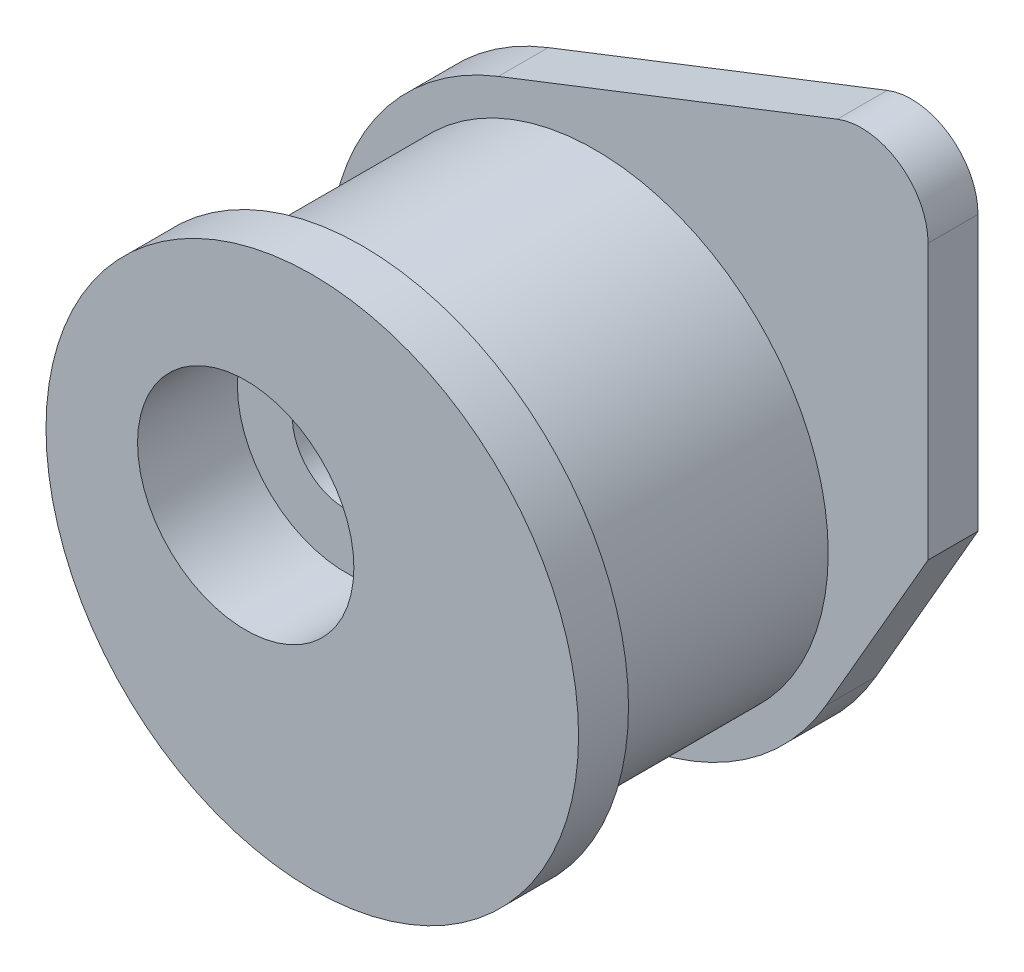
ISO-10303-21;
HEADER;
FILE_DESCRIPTION(('STEP AP214'),'2;1');
FILE_NAME('part.step','',(''),(''),'','','');
FILE_SCHEMA(('AUTOMOTIVE_DESIGN { 1 0 10303 214 1 1 1 1 }'));
ENDSEC;
DATA;
#1=APPLICATION_CONTEXT('core data for automotive mechanical design processes');
#2=APPLICATION_PROTOCOL_DEFINITION('international standard','automotive_design',2000,#1);
#3=PRODUCT_CONTEXT('',#1,'mechanical');
#4=PRODUCT('Part','Part','',(#3));
#5=PRODUCT_RELATED_PRODUCT_CATEGORY('part','',(#4));
#6=PRODUCT_DEFINITION_FORMATION('','',#4);
#7=PRODUCT_DEFINITION_CONTEXT('part definition',#1,'design');
#8=PRODUCT_DEFINITION('design','',#6,#7);
#9=PRODUCT_DEFINITION_SHAPE('','',#8);
#10=(LENGTH_UNIT() NAMED_UNIT(*) SI_UNIT(.MILLI.,.METRE.));
#11=(NAMED_UNIT(*) PLANE_ANGLE_UNIT() SI_UNIT($,.RADIAN.));
#12=(NAMED_UNIT(*) SI_UNIT($,.STERADIAN.) SOLID_ANGLE_UNIT());
#13=UNCERTAINTY_MEASURE_WITH_UNIT(LENGTH_MEASURE(1.E-05),#10,'distance_accuracy_value','');
#14=(GEOMETRIC_REPRESENTATION_CONTEXT(3) GLOBAL_UNCERTAINTY_ASSIGNED_CONTEXT((#13)) GLOBAL_UNIT_ASSIGNED_CONTEXT((#10,
#11,#12)) REPRESENTATION_CONTEXT('',''));
#15=CARTESIAN_POINT('',(0.,0.,0.));
#16=DIRECTION('',(0.,0.,1.));
#17=DIRECTION('',(1.,0.,0.));
#18=AXIS2_PLACEMENT_3D('',#15,#16,#17);
#19=CARTESIAN_POINT('',(2.,-1.,10.));
#20=DIRECTION('',(0.,0.,-1.));
#21=DIRECTION('',(-1.,0.,0.));
#22=AXIS2_PLACEMENT_3D('',#19,#20,#21);
#23=CYLINDRICAL_SURFACE('',#22,8.);
#24=CARTESIAN_POINT('',(2.,-1.,8.5));
#25=DIRECTION('',(0.,0.,1.));
#26=DIRECTION('',(1.,0.,0.));
#27=AXIS2_PLACEMENT_3D('',#24,#25,#26);
#28=CIRCLE('',#27,8.);
#29=CARTESIAN_POINT('',(10.,-1.,8.5));
#30=VERTEX_POINT('',#29);
#31=EDGE_CURVE('E138',#30,#30,#28,.T.);
#32=ORIENTED_EDGE('',*,*,#31,.T.);
#33=EDGE_LOOP('',(#32));
#34=FACE_BOUND('',#33,.T.);
#35=CARTESIAN_POINT('',(2.,-1.,10.));
#36=DIRECTION('',(0.,0.,1.));
#37=DIRECTION('',(1.,0.,0.));
#38=AXIS2_PLACEMENT_3D('',#35,#36,#37);
#39=CIRCLE('',#38,8.);
#40=CARTESIAN_POINT('',(10.,-1.,10.));
#41=VERTEX_POINT('',#40);
#42=EDGE_CURVE('E143',#41,#41,#39,.T.);
#43=ORIENTED_EDGE('',*,*,#42,.F.);
#44=EDGE_LOOP('',(#43));
#45=FACE_BOUND('',#44,.T.);
#46=ADVANCED_FACE('F39',(#34,#45),#23,.T.);
#47=CARTESIAN_POINT('',(0.,0.,10.));
#48=DIRECTION('',(0.,0.,-1.));
#49=DIRECTION('',(-1.,0.,0.));
#50=AXIS2_PLACEMENT_3D('',#47,#48,#49);
#51=CYLINDRICAL_SURFACE('',#50,1.6);
#52=CARTESIAN_POINT('',(0.,0.,0.));
#53=DIRECTION('',(0.,0.,1.));
#54=DIRECTION('',(1.,0.,0.));
#55=AXIS2_PLACEMENT_3D('',#52,#53,#54);
#56=CIRCLE('',#55,1.6);
#57=CARTESIAN_POINT('',(1.6,0.,0.));
#58=VERTEX_POINT('',#57);
#59=EDGE_CURVE('E139',#58,#58,#56,.T.);
#60=ORIENTED_EDGE('',*,*,#59,.F.);
#61=EDGE_LOOP('',(#60));
#62=FACE_BOUND('',#61,.T.);
#63=CARTESIAN_POINT('',(0.,0.,7.));
#64=DIRECTION('',(0.,0.,1.));
#65=DIRECTION('',(1.,0.,0.));
#66=AXIS2_PLACEMENT_3D('',#63,#64,#65);
#67=CIRCLE('',#66,1.6);
#68=CARTESIAN_POINT('',(1.6,0.,7.));
#69=VERTEX_POINT('',#68);
#70=EDGE_CURVE('E133',#69,#69,#67,.T.);
#71=ORIENTED_EDGE('',*,*,#70,.T.);
#72=EDGE_LOOP('',(#71));
#73=FACE_BOUND('',#72,.T.);
#74=ADVANCED_FACE('F177',(#62,#73),#51,.F.);
#75=CARTESIAN_POINT('',(2.,-1.,10.));
#76=DIRECTION('',(0.,0.,1.));
#77=DIRECTION('',(1.,0.,0.));
#78=AXIS2_PLACEMENT_3D('',#75,#76,#77);
#79=PLANE('',#78);
#80=CARTESIAN_POINT('',(0.,0.,10.));
#81=DIRECTION('',(0.,0.,1.));
#82=DIRECTION('',(1.,0.,0.));
#83=AXIS2_PLACEMENT_3D('',#80,#81,#82);
#84=CIRCLE('',#83,3.25);
#85=CARTESIAN_POINT('',(3.25,0.,10.));
#86=VERTEX_POINT('',#85);
#87=EDGE_CURVE('E134',#86,#86,#84,.T.);
#88=ORIENTED_EDGE('',*,*,#87,.F.);
#89=EDGE_LOOP('',(#88));
#90=FACE_BOUND('',#89,.T.);
#91=ORIENTED_EDGE('',*,*,#42,.T.);
#92=EDGE_LOOP('',(#91));
#93=FACE_BOUND('',#92,.T.);
#94=ADVANCED_FACE('F182',(#90,#93),#79,.T.);
#95=CARTESIAN_POINT('',(2.,-1.,0.));
#96=DIRECTION('',(0.,0.,1.));
#97=DIRECTION('',(1.,0.,0.));
#98=AXIS2_PLACEMENT_3D('',#95,#96,#97);
#99=PLANE('',#98);
#100=DIRECTION('',(-0.931443867247837,-0.363885039767223,0.));
#101=VECTOR('',#100,1.);
#102=CARTESIAN_POINT('',(-0.911080318137789,6.4515509379827,0.));
#103=LINE('',#102,#101);
#104=CARTESIAN_POINT('',(9.27222992046555,10.4298413980241,0.));
#105=VERTEX_POINT('',#104);
#106=CARTESIAN_POINT('',(-0.911080318137787,6.4515509379827,0.));
#107=VERTEX_POINT('',#106);
#108=EDGE_CURVE('E108',#105,#107,#103,.T.);
#109=ORIENTED_EDGE('',*,*,#108,.F.);
#110=CARTESIAN_POINT('',(10.,8.56695366352844,0.));
#111=DIRECTION('',(0.,0.,1.));
#112=DIRECTION('',(1.,0.,0.));
#113=AXIS2_PLACEMENT_3D('',#110,#111,#112);
#114=CIRCLE('',#113,2.);
#115=CARTESIAN_POINT('',(12.,8.56695366352844,0.));
#116=VERTEX_POINT('',#115);
#117=EDGE_CURVE('E61',#105,#116,#114,.F.);
#118=ORIENTED_EDGE('',*,*,#117,.T.);
#119=DIRECTION('',(0.,1.,0.));
#120=VECTOR('',#119,1.);
#121=CARTESIAN_POINT('',(12.,11.4954930800735,0.));
#122=LINE('',#121,#120);
#123=CARTESIAN_POINT('',(12.,0.324258737207005,0.));
#124=VERTEX_POINT('',#123);
#125=EDGE_CURVE('E88',#124,#116,#122,.T.);
#126=ORIENTED_EDGE('',*,*,#125,.F.);
#127=DIRECTION('',(0.499735709859631,0.866177938007596,0.));
#128=VECTOR('',#127,1.);
#129=CARTESIAN_POINT('',(12.,0.324258737207005,0.));
#130=LINE('',#129,#128);
#131=CARTESIAN_POINT('',(8.92942350406077,-4.99788567887705,0.));
#132=VERTEX_POINT('',#131);
#133=EDGE_CURVE('E99',#132,#124,#130,.T.);
#134=ORIENTED_EDGE('',*,*,#133,.F.);
#135=CARTESIAN_POINT('',(2.,-1.,0.));
#136=DIRECTION('',(0.,0.,1.));
#137=DIRECTION('',(1.,0.,0.));
#138=AXIS2_PLACEMENT_3D('',#135,#136,#137);
#139=CIRCLE('',#138,8.);
#140=EDGE_CURVE('E142',#107,#132,#139,.T.);
#141=ORIENTED_EDGE('',*,*,#140,.F.);
#142=EDGE_LOOP('',(#109,#118,#126,#134,#141));
#143=FACE_BOUND('',#142,.T.);
#144=ORIENTED_EDGE('',*,*,#59,.T.);
#145=EDGE_LOOP('',(#144));
#146=FACE_BOUND('',#145,.T.);
#147=ADVANCED_FACE('F105',(#143,#146),#99,.F.);
#148=CARTESIAN_POINT('',(2.,-1.,1.5));
#149=DIRECTION('',(0.,0.,-1.));
#150=DIRECTION('',(-1.,0.,0.));
#151=AXIS2_PLACEMENT_3D('',#148,#149,#150);
#152=CIRCLE('',#151,8.);
#153=CARTESIAN_POINT('',(8.92942350406076,-4.99788567887705,1.5));
#154=VERTEX_POINT('',#153);
#155=CARTESIAN_POINT('',(-0.911080318137789,6.4515509379827,1.5));
#156=VERTEX_POINT('',#155);
#157=EDGE_CURVE('E129',#154,#156,#152,.T.);
#158=ORIENTED_EDGE('',*,*,#157,.T.);
#159=DIRECTION('',(0.,0.,-1.));
#160=VECTOR('',#159,1.);
#161=CARTESIAN_POINT('',(-0.911080318137789,6.4515509379827,22.4458238765537));
#162=LINE('',#161,#160);
#163=EDGE_CURVE('E95',#156,#107,#162,.T.);
#164=ORIENTED_EDGE('',*,*,#163,.T.);
#165=ORIENTED_EDGE('',*,*,#140,.T.);
#166=DIRECTION('',(0.,0.,-1.));
#167=VECTOR('',#166,1.);
#168=CARTESIAN_POINT('',(8.92942350406076,-4.99788567887705,22.4458238765537));
#169=LINE('',#168,#167);
#170=EDGE_CURVE('E94',#154,#132,#169,.T.);
#171=ORIENTED_EDGE('',*,*,#170,.F.);
#172=EDGE_LOOP('',(#158,#164,#165,#171));
#173=FACE_BOUND('',#172,.T.);
#174=ADVANCED_FACE('F168',(#173),#23,.T.);
#175=CARTESIAN_POINT('',(0.,0.,7.));
#176=DIRECTION('',(0.,0.,1.));
#177=DIRECTION('',(1.,0.,0.));
#178=AXIS2_PLACEMENT_3D('',#175,#176,#177);
#179=CYLINDRICAL_SURFACE('',#178,3.25);
#180=CARTESIAN_POINT('',(0.,0.,7.));
#181=DIRECTION('',(0.,0.,1.));
#182=DIRECTION('',(1.,0.,0.));
#183=AXIS2_PLACEMENT_3D('',#180,#181,#182);
#184=CIRCLE('',#183,3.25);
#185=CARTESIAN_POINT('',(3.25,0.,7.));
#186=VERTEX_POINT('',#185);
#187=EDGE_CURVE('E130',#186,#186,#184,.T.);
#188=ORIENTED_EDGE('',*,*,#187,.F.);
#189=EDGE_LOOP('',(#188));
#190=FACE_BOUND('',#189,.T.);
#191=ORIENTED_EDGE('',*,*,#87,.T.);
#192=EDGE_LOOP('',(#191));
#193=FACE_BOUND('',#192,.T.);
#194=ADVANCED_FACE('F188',(#190,#193),#179,.F.);
#195=CARTESIAN_POINT('',(0.,0.,7.));
#196=DIRECTION('',(0.,0.,1.));
#197=DIRECTION('',(1.,0.,0.));
#198=AXIS2_PLACEMENT_3D('',#195,#196,#197);
#199=PLANE('',#198);
#200=ORIENTED_EDGE('',*,*,#70,.F.);
#201=EDGE_LOOP('',(#200));
#202=FACE_BOUND('',#201,.T.);
#203=ORIENTED_EDGE('',*,*,#187,.T.);
#204=EDGE_LOOP('',(#203));
#205=FACE_BOUND('',#204,.T.);
#206=ADVANCED_FACE('F193',(#202,#205),#199,.T.);
#207=CARTESIAN_POINT('',(-11.5049540413605,-1.,8.5));
#208=DIRECTION('',(0.,0.,1.));
#209=DIRECTION('',(1.,0.,0.));
#210=AXIS2_PLACEMENT_3D('',#207,#208,#209);
#211=PLANE('',#210);
#212=CARTESIAN_POINT('',(2.,-1.,8.5));
#213=DIRECTION('',(0.,0.,-1.));
#214=DIRECTION('',(-1.,0.,0.));
#215=AXIS2_PLACEMENT_3D('',#212,#213,#214);
#216=CIRCLE('',#215,7.);
#217=CARTESIAN_POINT('',(-5.,-1.,8.5));
#218=VERTEX_POINT('',#217);
#219=EDGE_CURVE('E124',#218,#218,#216,.T.);
#220=ORIENTED_EDGE('',*,*,#219,.F.);
#221=EDGE_LOOP('',(#220));
#222=FACE_BOUND('',#221,.T.);
#223=ORIENTED_EDGE('',*,*,#31,.F.);
#224=EDGE_LOOP('',(#223));
#225=FACE_BOUND('',#224,.T.);
#226=ADVANCED_FACE('F204',(#222,#225),#211,.F.);
#227=CARTESIAN_POINT('',(-11.5049540413605,-1.,1.5));
#228=DIRECTION('',(0.,0.,-1.));
#229=DIRECTION('',(-1.,0.,0.));
#230=AXIS2_PLACEMENT_3D('',#227,#228,#229);
#231=PLANE('',#230);
#232=CARTESIAN_POINT('',(2.,-1.,1.5));
#233=DIRECTION('',(0.,0.,-1.));
#234=DIRECTION('',(-1.,0.,0.));
#235=AXIS2_PLACEMENT_3D('',#232,#233,#234);
#236=CIRCLE('',#235,7.);
#237=CARTESIAN_POINT('',(-5.,-1.,1.5));
#238=VERTEX_POINT('',#237);
#239=EDGE_CURVE('E120',#238,#238,#236,.T.);
#240=ORIENTED_EDGE('',*,*,#239,.T.);
#241=EDGE_LOOP('',(#240));
#242=FACE_BOUND('',#241,.T.);
#243=DIRECTION('',(0.,-1.,0.));
#244=VECTOR('',#243,1.);
#245=CARTESIAN_POINT('',(12.,11.4954930800735,1.5));
#246=LINE('',#245,#244);
#247=CARTESIAN_POINT('',(12.,8.56695366352844,1.5));
#248=VERTEX_POINT('',#247);
#249=CARTESIAN_POINT('',(12.,0.324258737207005,1.5));
#250=VERTEX_POINT('',#249);
#251=EDGE_CURVE('E89',#248,#250,#246,.T.);
#252=ORIENTED_EDGE('',*,*,#251,.F.);
#253=CARTESIAN_POINT('',(10.,8.56695366352844,1.5));
#254=DIRECTION('',(0.,0.,-1.));
#255=DIRECTION('',(-1.,0.,0.));
#256=AXIS2_PLACEMENT_3D('',#253,#254,#255);
#257=CIRCLE('',#256,2.);
#258=CARTESIAN_POINT('',(9.27222992046556,10.4298413980241,1.5));
#259=VERTEX_POINT('',#258);
#260=EDGE_CURVE('E11',#248,#259,#257,.F.);
#261=ORIENTED_EDGE('',*,*,#260,.T.);
#262=DIRECTION('',(0.931443867247837,0.363885039767223,0.));
#263=VECTOR('',#262,1.);
#264=CARTESIAN_POINT('',(-0.911080318137789,6.4515509379827,1.5));
#265=LINE('',#264,#263);
#266=EDGE_CURVE('E117',#156,#259,#265,.T.);
#267=ORIENTED_EDGE('',*,*,#266,.F.);
#268=ORIENTED_EDGE('',*,*,#157,.F.);
#269=DIRECTION('',(-0.499735709859631,-0.866177938007596,0.));
#270=VECTOR('',#269,1.);
#271=CARTESIAN_POINT('',(12.,0.324258737207005,1.5));
#272=LINE('',#271,#270);
#273=EDGE_CURVE('E125',#250,#154,#272,.T.);
#274=ORIENTED_EDGE('',*,*,#273,.F.);
#275=EDGE_LOOP('',(#252,#261,#267,#268,#274));
#276=FACE_BOUND('',#275,.T.);
#277=ADVANCED_FACE('F170',(#242,#276),#231,.F.);
#278=CARTESIAN_POINT('',(2.,-1.,0.));
#279=DIRECTION('',(0.,0.,-1.));
#280=DIRECTION('',(-1.,0.,0.));
#281=AXIS2_PLACEMENT_3D('',#278,#279,#280);
#282=CYLINDRICAL_SURFACE('',#281,7.);
#283=ORIENTED_EDGE('',*,*,#239,.F.);
#284=EDGE_LOOP('',(#283));
#285=FACE_BOUND('',#284,.T.);
#286=ORIENTED_EDGE('',*,*,#219,.T.);
#287=EDGE_LOOP('',(#286));
#288=FACE_BOUND('',#287,.T.);
#289=ADVANCED_FACE('F209',(#285,#288),#282,.T.);
#290=CARTESIAN_POINT('',(-0.911080318137789,6.4515509379827,22.4458238765537));
#291=DIRECTION('',(0.363885039767223,-0.931443867247837,0.));
#292=DIRECTION('',(0.931443867247837,0.363885039767223,0.));
#293=AXIS2_PLACEMENT_3D('',#290,#291,#292);
#294=PLANE('',#293);
#295=ORIENTED_EDGE('',*,*,#266,.T.);
#296=DIRECTION('',(0.,0.,-1.));
#297=VECTOR('',#296,1.);
#298=CARTESIAN_POINT('',(9.27222992046555,10.4298413980241,22.4458238765537));
#299=LINE('',#298,#297);
#300=EDGE_CURVE('E147',#259,#105,#299,.T.);
#301=ORIENTED_EDGE('',*,*,#300,.T.);
#302=ORIENTED_EDGE('',*,*,#108,.T.);
#303=ORIENTED_EDGE('',*,*,#163,.F.);
#304=EDGE_LOOP('',(#295,#301,#302,#303));
#305=FACE_BOUND('',#304,.T.);
#306=ADVANCED_FACE('F162',(#305),#294,.F.);
#307=CARTESIAN_POINT('',(12.,11.4954930800735,22.4458238765537));
#308=DIRECTION('',(-1.,0.,0.));
#309=DIRECTION('',(0.,0.,1.));
#310=AXIS2_PLACEMENT_3D('',#307,#308,#309);
#311=PLANE('',#310);
#312=ORIENTED_EDGE('',*,*,#125,.T.);
#313=DIRECTION('',(0.,0.,-1.));
#314=VECTOR('',#313,1.);
#315=CARTESIAN_POINT('',(12.,8.56695366352844,22.4458238765537));
#316=LINE('',#315,#314);
#317=EDGE_CURVE('E47',#116,#248,#316,.F.);
#318=ORIENTED_EDGE('',*,*,#317,.T.);
#319=ORIENTED_EDGE('',*,*,#251,.T.);
#320=DIRECTION('',(0.,0.,-1.));
#321=VECTOR('',#320,1.);
#322=CARTESIAN_POINT('',(12.,0.324258737207005,22.4458238765537));
#323=LINE('',#322,#321);
#324=EDGE_CURVE('E85',#250,#124,#323,.T.);
#325=ORIENTED_EDGE('',*,*,#324,.T.);
#326=EDGE_LOOP('',(#312,#318,#319,#325));
#327=FACE_BOUND('',#326,.T.);
#328=ADVANCED_FACE('F87',(#327),#311,.F.);
#329=CARTESIAN_POINT('',(12.,0.324258737207005,22.4458238765537));
#330=DIRECTION('',(-0.866177938007596,0.499735709859631,0.));
#331=DIRECTION('',(-0.499735709859631,-0.866177938007596,0.));
#332=AXIS2_PLACEMENT_3D('',#329,#330,#331);
#333=PLANE('',#332);
#334=ORIENTED_EDGE('',*,*,#324,.F.);
#335=ORIENTED_EDGE('',*,*,#273,.T.);
#336=ORIENTED_EDGE('',*,*,#170,.T.);
#337=ORIENTED_EDGE('',*,*,#133,.T.);
#338=EDGE_LOOP('',(#334,#335,#336,#337));
#339=FACE_BOUND('',#338,.T.);
#340=ADVANCED_FACE('F100',(#339),#333,.F.);
#341=CARTESIAN_POINT('',(10.,8.56695366352844,22.4458238765537));
#342=DIRECTION('',(0.,0.,-1.));
#343=DIRECTION('',(-1.,0.,0.));
#344=AXIS2_PLACEMENT_3D('',#341,#342,#343);
#345=CYLINDRICAL_SURFACE('',#344,2.);
#346=ORIENTED_EDGE('',*,*,#260,.F.);
#347=ORIENTED_EDGE('',*,*,#317,.F.);
#348=ORIENTED_EDGE('',*,*,#117,.F.);
#349=ORIENTED_EDGE('',*,*,#300,.F.);
#350=EDGE_LOOP('',(#346,#347,#348,#349));
#351=FACE_BOUND('',#350,.T.);
#352=ADVANCED_FACE('F41',(#351),#345,.T.);
#353=CLOSED_SHELL('',(#46,#74,#94,#147,#174,#194,#206,#226,#277,#289,#306,#328,#340,#352));
#354=MANIFOLD_SOLID_BREP('B2',#353);
#355=ADVANCED_BREP_SHAPE_REPRESENTATION('',(#18,#354),#14);
#356=SHAPE_DEFINITION_REPRESENTATION(#9,#355);
ENDSEC;
END-ISO-10303-21;
